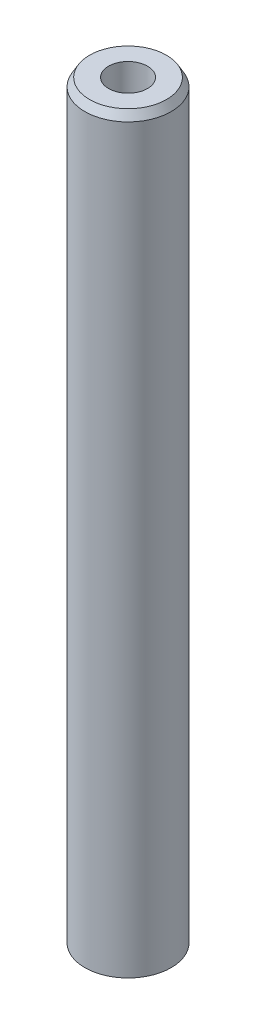
ISO-10303-21;
HEADER;
FILE_DESCRIPTION(('STEP AP214'),'2;1');
FILE_NAME('part.step','',(''),(''),'','','');
FILE_SCHEMA(('AUTOMOTIVE_DESIGN { 1 0 10303 214 1 1 1 1 }'));
ENDSEC;
DATA;
#1=APPLICATION_CONTEXT('core data for automotive mechanical design processes');
#2=APPLICATION_PROTOCOL_DEFINITION('international standard','automotive_design',2000,#1);
#3=PRODUCT_CONTEXT('',#1,'mechanical');
#4=PRODUCT('Part','Part','',(#3));
#5=PRODUCT_RELATED_PRODUCT_CATEGORY('part','',(#4));
#6=PRODUCT_DEFINITION_FORMATION('','',#4);
#7=PRODUCT_DEFINITION_CONTEXT('part definition',#1,'design');
#8=PRODUCT_DEFINITION('design','',#6,#7);
#9=PRODUCT_DEFINITION_SHAPE('','',#8);
#10=(LENGTH_UNIT() NAMED_UNIT(*) SI_UNIT(.MILLI.,.METRE.));
#11=(NAMED_UNIT(*) PLANE_ANGLE_UNIT() SI_UNIT($,.RADIAN.));
#12=(NAMED_UNIT(*) SI_UNIT($,.STERADIAN.) SOLID_ANGLE_UNIT());
#13=UNCERTAINTY_MEASURE_WITH_UNIT(LENGTH_MEASURE(1.E-05),#10,'distance_accuracy_value','');
#14=(GEOMETRIC_REPRESENTATION_CONTEXT(3) GLOBAL_UNCERTAINTY_ASSIGNED_CONTEXT((#13)) GLOBAL_UNIT_ASSIGNED_CONTEXT((#10,
#11,#12)) REPRESENTATION_CONTEXT('',''));
#15=CARTESIAN_POINT('',(0.,0.,0.));
#16=DIRECTION('',(0.,0.,1.));
#17=DIRECTION('',(1.,0.,0.));
#18=AXIS2_PLACEMENT_3D('',#15,#16,#17);
#19=CARTESIAN_POINT('',(0.,480.852490189019,0.));
#20=DIRECTION('',(0.,-1.,0.));
#21=DIRECTION('',(0.,0.,-1.));
#22=AXIS2_PLACEMENT_3D('',#19,#20,#21);
#23=CYLINDRICAL_SURFACE('',#22,27.5);
#24=CARTESIAN_POINT('',(0.,475.674728446264,0.));
#25=DIRECTION('',(0.,1.,0.));
#26=DIRECTION('',(0.,0.,1.));
#27=AXIS2_PLACEMENT_3D('',#24,#25,#26);
#28=CIRCLE('',#27,27.5);
#29=CARTESIAN_POINT('',(0.,475.674728446264,-27.5));
#30=VERTEX_POINT('',#29);
#31=EDGE_CURVE('E50',#30,#30,#28,.F.);
#32=CARTESIAN_POINT('',(0.,2.98938213597921,0.));
#33=DIRECTION('',(0.,1.,0.));
#34=DIRECTION('',(0.,0.,1.));
#35=AXIS2_PLACEMENT_3D('',#32,#33,#34);
#36=CIRCLE('',#35,27.5);
#37=CARTESIAN_POINT('',(0.,2.98938213597921,-27.5));
#38=VERTEX_POINT('',#37);
#39=EDGE_CURVE('E51',#38,#38,#36,.T.);
#40=CARTESIAN_POINT('',(0.,475.674728446264,-27.5));
#41=CARTESIAN_POINT('',(0.,470.750922755532,-27.5));
#42=CARTESIAN_POINT('',(0.,465.8271170648,-27.5));
#43=CARTESIAN_POINT('',(0.,455.979505683336,-27.5));
#44=CARTESIAN_POINT('',(0.,451.055699992604,-27.5));
#45=CARTESIAN_POINT('',(0.,441.208088611139,-27.5));
#46=CARTESIAN_POINT('',(0.,436.284282920407,-27.5));
#47=CARTESIAN_POINT('',(0.,426.436671538943,-27.5));
#48=CARTESIAN_POINT('',(0.,421.512865848211,-27.5));
#49=CARTESIAN_POINT('',(0.,411.665254466746,-27.5));
#50=CARTESIAN_POINT('',(0.,406.741448776014,-27.5));
#51=CARTESIAN_POINT('',(0.,396.89383739455,-27.5));
#52=CARTESIAN_POINT('',(0.,391.970031703818,-27.5));
#53=CARTESIAN_POINT('',(0.,382.122420322354,-27.5));
#54=CARTESIAN_POINT('',(0.,377.198614631622,-27.5));
#55=CARTESIAN_POINT('',(0.,367.351003250157,-27.5));
#56=CARTESIAN_POINT('',(0.,362.427197559425,-27.5));
#57=CARTESIAN_POINT('',(0.,352.579586177961,-27.5));
#58=CARTESIAN_POINT('',(0.,347.655780487229,-27.5));
#59=CARTESIAN_POINT('',(0.,337.808169105764,-27.5));
#60=CARTESIAN_POINT('',(0.,332.884363415032,-27.5));
#61=CARTESIAN_POINT('',(0.,323.036752033568,-27.5));
#62=CARTESIAN_POINT('',(0.,318.112946342836,-27.5));
#63=CARTESIAN_POINT('',(0.,308.265334961372,-27.5));
#64=CARTESIAN_POINT('',(0.,303.34152927064,-27.5));
#65=CARTESIAN_POINT('',(0.,293.493917889175,-27.5));
#66=CARTESIAN_POINT('',(0.,288.570112198443,-27.5));
#67=CARTESIAN_POINT('',(0.,278.722500816979,-27.5));
#68=CARTESIAN_POINT('',(0.,273.798695126247,-27.5));
#69=CARTESIAN_POINT('',(0.,263.951083744782,-27.5));
#70=CARTESIAN_POINT('',(0.,259.02727805405,-27.5));
#71=CARTESIAN_POINT('',(0.,249.179666672586,-27.5));
#72=CARTESIAN_POINT('',(0.,244.255860981854,-27.5));
#73=CARTESIAN_POINT('',(0.,234.40824960039,-27.5));
#74=CARTESIAN_POINT('',(0.,229.484443909658,-27.5));
#75=CARTESIAN_POINT('',(0.,219.636832528193,-27.5));
#76=CARTESIAN_POINT('',(0.,214.713026837461,-27.5));
#77=CARTESIAN_POINT('',(0.,204.865415455997,-27.5));
#78=CARTESIAN_POINT('',(0.,199.941609765265,-27.5));
#79=CARTESIAN_POINT('',(0.,190.0939983838,-27.5));
#80=CARTESIAN_POINT('',(0.,185.170192693068,-27.5));
#81=CARTESIAN_POINT('',(0.,175.322581311604,-27.5));
#82=CARTESIAN_POINT('',(0.,170.398775620872,-27.5));
#83=CARTESIAN_POINT('',(0.,160.551164239408,-27.5));
#84=CARTESIAN_POINT('',(0.,155.627358548675,-27.5));
#85=CARTESIAN_POINT('',(0.,145.779747167211,-27.5));
#86=CARTESIAN_POINT('',(0.,140.855941476479,-27.5));
#87=CARTESIAN_POINT('',(0.,131.008330095015,-27.5));
#88=CARTESIAN_POINT('',(0.,126.084524404283,-27.5));
#89=CARTESIAN_POINT('',(0.,116.236913022818,-27.5));
#90=CARTESIAN_POINT('',(0.,111.313107332086,-27.5));
#91=CARTESIAN_POINT('',(0.,101.465495950622,-27.5));
#92=CARTESIAN_POINT('',(0.,96.5416902598898,-27.5));
#93=CARTESIAN_POINT('',(0.,86.6940788784255,-27.5));
#94=CARTESIAN_POINT('',(0.,81.7702731876934,-27.5));
#95=CARTESIAN_POINT('',(0.,71.9226618062291,-27.5));
#96=CARTESIAN_POINT('',(0.,66.998856115497,-27.5));
#97=CARTESIAN_POINT('',(0.,57.1512447340328,-27.5));
#98=CARTESIAN_POINT('',(0.,52.2274390433006,-27.5));
#99=CARTESIAN_POINT('',(0.,42.3798276618363,-27.5));
#100=CARTESIAN_POINT('',(0.,37.4560219711042,-27.5));
#101=CARTESIAN_POINT('',(0.,27.6084105896399,-27.5));
#102=CARTESIAN_POINT('',(0.,22.6846048989078,-27.5));
#103=CARTESIAN_POINT('',(0.,12.8369935174435,-27.5));
#104=CARTESIAN_POINT('',(0.,7.91318782671135,-27.5));
#105=CARTESIAN_POINT('',(0.,2.98938213597921,-27.5));
#106=B_SPLINE_CURVE_WITH_KNOTS('',3,(#40,#41,#42,#43,#44,#45,#46,#47,#48,#49,#50,#51,#52,#53,
#54,#55,#56,#57,#58,#59,#60,#61,#62,#63,#64,#65,#66,#67,#68,#69,#70,#71,#72,#73,#74,#75,#76,#77,
#78,#79,#80,#81,#82,#83,#84,#85,#86,#87,#88,#89,#90,#91,#92,#93,#94,#95,#96,#97,#98,#99,#100,
#101,#102,#103,#104,#105),.UNSPECIFIED.,.F.,.F.,(4,2,2,2,2,2,2,2,2,2,2,2,2,2,2,2,2,2,2,2,2,2,2,
2,2,2,2,2,2,2,2,2,4),(0.,14.7714170721964,29.5428341443928,44.3142512165892,59.0856682887856,
73.857085360982,88.6285024331784,103.399919505375,118.171336577571,132.942753649768,
147.714170721964,162.48558779416,177.257004866357,192.028421938553,206.79983901075,
221.571256082946,236.342673155142,251.114090227339,265.885507299535,280.656924371732,
295.428341443928,310.199758516124,324.971175588321,339.742592660517,354.514009732714,
369.28542680491,384.056843877107,398.828260949303,413.599678021499,428.371095093696,
443.142512165892,457.913929238089,472.685346310285),.UNSPECIFIED.);
#107=EDGE_CURVE('BSEAM39',#30,#38,#106,.T.);
#108=ORIENTED_EDGE('',*,*,#31,.T.);
#109=ORIENTED_EDGE('',*,*,#39,.T.);
#110=ORIENTED_EDGE('',*,*,#107,.T.);
#111=ORIENTED_EDGE('',*,*,#107,.F.);
#112=EDGE_LOOP('',(#108,#110,#109,#111));
#113=FACE_BOUND('',#112,.T.);
#114=ADVANCED_FACE('F39',(#113),#23,.T.);
#115=CARTESIAN_POINT('',(0.,480.852490189019,0.));
#116=DIRECTION('',(0.,1.,0.));
#117=DIRECTION('',(0.,0.,1.));
#118=AXIS2_PLACEMENT_3D('',#115,#116,#117);
#119=PLANE('',#118);
#120=CARTESIAN_POINT('',(0.,480.852490189019,0.));
#121=DIRECTION('',(0.,1.,0.));
#122=DIRECTION('',(0.,0.,1.));
#123=AXIS2_PLACEMENT_3D('',#120,#121,#122);
#124=CIRCLE('',#123,24.5106178640207);
#125=CARTESIAN_POINT('',(0.,480.852490189019,-24.5106178640207));
#126=VERTEX_POINT('',#125);
#127=EDGE_CURVE('E54',#126,#126,#124,.T.);
#128=ORIENTED_EDGE('',*,*,#127,.T.);
#129=EDGE_LOOP('',(#128));
#130=FACE_BOUND('',#129,.T.);
#131=CARTESIAN_POINT('',(0.,480.852490189019,0.));
#132=DIRECTION('',(0.,1.,0.));
#133=DIRECTION('',(0.,0.,1.));
#134=AXIS2_PLACEMENT_3D('',#131,#132,#133);
#135=CIRCLE('',#134,12.4075242570736);
#136=CARTESIAN_POINT('',(0.,480.852490189019,12.4075242570736));
#137=VERTEX_POINT('',#136);
#138=EDGE_CURVE('E58',#137,#137,#135,.T.);
#139=ORIENTED_EDGE('',*,*,#138,.F.);
#140=EDGE_LOOP('',(#139));
#141=FACE_BOUND('',#140,.T.);
#142=ADVANCED_FACE('F69',(#130,#141),#119,.T.);
#143=CARTESIAN_POINT('',(0.,0.,0.));
#144=DIRECTION('',(0.,1.,0.));
#145=DIRECTION('',(0.,0.,1.));
#146=AXIS2_PLACEMENT_3D('',#143,#144,#145);
#147=PLANE('',#146);
#148=CARTESIAN_POINT('',(0.,0.,0.));
#149=DIRECTION('',(0.,1.,0.));
#150=DIRECTION('',(0.,0.,1.));
#151=AXIS2_PLACEMENT_3D('',#148,#149,#150);
#152=CIRCLE('',#151,22.3222382572452);
#153=CARTESIAN_POINT('',(0.,0.,22.3222382572452));
#154=VERTEX_POINT('',#153);
#155=EDGE_CURVE('E10',#154,#154,#152,.F.);
#156=ORIENTED_EDGE('',*,*,#155,.T.);
#157=EDGE_LOOP('',(#156));
#158=FACE_BOUND('',#157,.T.);
#159=CARTESIAN_POINT('',(0.,0.,0.));
#160=DIRECTION('',(0.,1.,0.));
#161=DIRECTION('',(0.,0.,1.));
#162=AXIS2_PLACEMENT_3D('',#159,#160,#161);
#163=CIRCLE('',#162,12.4075242570736);
#164=CARTESIAN_POINT('',(0.,0.,12.4075242570736));
#165=VERTEX_POINT('',#164);
#166=EDGE_CURVE('E63',#165,#165,#163,.T.);
#167=ORIENTED_EDGE('',*,*,#166,.T.);
#168=EDGE_LOOP('',(#167));
#169=FACE_BOUND('',#168,.T.);
#170=ADVANCED_FACE('F75',(#158,#169),#147,.F.);
#171=CARTESIAN_POINT('',(0.,480.852490189019,0.));
#172=DIRECTION('',(0.,-1.,0.));
#173=DIRECTION('',(0.,0.,-1.));
#174=AXIS2_PLACEMENT_3D('',#171,#172,#173);
#175=CYLINDRICAL_SURFACE('',#174,12.4075242570736);
#176=ORIENTED_EDGE('',*,*,#138,.T.);
#177=EDGE_LOOP('',(#176));
#178=FACE_BOUND('',#177,.T.);
#179=ORIENTED_EDGE('',*,*,#166,.F.);
#180=EDGE_LOOP('',(#179));
#181=FACE_BOUND('',#180,.T.);
#182=ADVANCED_FACE('F70',(#178,#181),#175,.F.);
#183=CARTESIAN_POINT('',(0.,480.852490189019,0.));
#184=DIRECTION('',(0.,-1.,0.));
#185=DIRECTION('',(0.,0.,-1.));
#186=AXIS2_PLACEMENT_3D('',#183,#184,#185);
#187=CONICAL_SURFACE('',#186,24.5106178640207,0.5235987755983);
#188=CARTESIAN_POINT('',(0.,475.674728446264,-27.5));
#189=CARTESIAN_POINT('',(0.,475.728663464418,-27.4688606027502));
#190=CARTESIAN_POINT('',(0.,475.782598482572,-27.4377212055004));
#191=CARTESIAN_POINT('',(0.,475.890468518879,-27.3754424110009));
#192=CARTESIAN_POINT('',(0.,475.944403537033,-27.3443030137511));
#193=CARTESIAN_POINT('',(0.,476.05227357334,-27.2820242192515));
#194=CARTESIAN_POINT('',(0.,476.106208591494,-27.2508848220017));
#195=CARTESIAN_POINT('',(0.,476.214078627801,-27.1886060275022));
#196=CARTESIAN_POINT('',(0.,476.268013645955,-27.1574666302524));
#197=CARTESIAN_POINT('',(0.,476.375883682262,-27.0951878357528));
#198=CARTESIAN_POINT('',(0.,476.429818700416,-27.064048438503));
#199=CARTESIAN_POINT('',(0.,476.537688736723,-27.0017696440035));
#200=CARTESIAN_POINT('',(0.,476.591623754877,-26.9706302467537));
#201=CARTESIAN_POINT('',(0.,476.699493791185,-26.9083514522541));
#202=CARTESIAN_POINT('',(0.,476.753428809338,-26.8772120550043));
#203=CARTESIAN_POINT('',(0.,476.861298845646,-26.8149332605048));
#204=CARTESIAN_POINT('',(0.,476.915233863799,-26.783793863255));
#205=CARTESIAN_POINT('',(0.,477.023103900107,-26.7215150687554));
#206=CARTESIAN_POINT('',(0.,477.07703891826,-26.6903756715056));
#207=CARTESIAN_POINT('',(0.,477.184908954568,-26.6280968770061));
#208=CARTESIAN_POINT('',(0.,477.238843972721,-26.5969574797563));
#209=CARTESIAN_POINT('',(0.,477.346714009029,-26.5346786852567));
#210=CARTESIAN_POINT('',(0.,477.400649027183,-26.5035392880069));
#211=CARTESIAN_POINT('',(0.,477.50851906349,-26.4412604935073));
#212=CARTESIAN_POINT('',(0.,477.562454081644,-26.4101210962576));
#213=CARTESIAN_POINT('',(0.,477.670324117951,-26.347842301758));
#214=CARTESIAN_POINT('',(0.,477.724259136105,-26.3167029045082));
#215=CARTESIAN_POINT('',(0.,477.832129172412,-26.2544241100086));
#216=CARTESIAN_POINT('',(0.,477.886064190566,-26.2232847127589));
#217=CARTESIAN_POINT('',(0.,477.993934226873,-26.1610059182593));
#218=CARTESIAN_POINT('',(0.,478.047869245027,-26.1298665210095));
#219=CARTESIAN_POINT('',(0.,478.155739281334,-26.0675877265099));
#220=CARTESIAN_POINT('',(0.,478.209674299488,-26.0364483292601));
#221=CARTESIAN_POINT('',(0.,478.317544335795,-25.9741695347606));
#222=CARTESIAN_POINT('',(0.,478.371479353949,-25.9430301375108));
#223=CARTESIAN_POINT('',(0.,478.479349390257,-25.8807513430112));
#224=CARTESIAN_POINT('',(0.,478.53328440841,-25.8496119457614));
#225=CARTESIAN_POINT('',(0.,478.641154444718,-25.7873331512619));
#226=CARTESIAN_POINT('',(0.,478.695089462871,-25.7561937540121));
#227=CARTESIAN_POINT('',(0.,478.802959499179,-25.6939149595125));
#228=CARTESIAN_POINT('',(0.,478.856894517332,-25.6627755622627));
#229=CARTESIAN_POINT('',(0.,478.96476455364,-25.6004967677632));
#230=CARTESIAN_POINT('',(0.,479.018699571793,-25.5693573705134));
#231=CARTESIAN_POINT('',(0.,479.126569608101,-25.5070785760138));
#232=CARTESIAN_POINT('',(0.,479.180504626255,-25.475939178764));
#233=CARTESIAN_POINT('',(0.,479.288374662562,-25.4136603842645));
#234=CARTESIAN_POINT('',(0.,479.342309680716,-25.3825209870147));
#235=CARTESIAN_POINT('',(0.,479.450179717023,-25.3202421925151));
#236=CARTESIAN_POINT('',(0.,479.504114735177,-25.2891027952653));
#237=CARTESIAN_POINT('',(0.,479.611984771484,-25.2268240007658));
#238=CARTESIAN_POINT('',(0.,479.665919789638,-25.195684603516));
#239=CARTESIAN_POINT('',(0.,479.773789825945,-25.1334058090164));
#240=CARTESIAN_POINT('',(0.,479.827724844099,-25.1022664117666));
#241=CARTESIAN_POINT('',(0.,479.935594880406,-25.039987617267));
#242=CARTESIAN_POINT('',(0.,479.98952989856,-25.0088482200173));
#243=CARTESIAN_POINT('',(0.,480.097399934867,-24.9465694255177));
#244=CARTESIAN_POINT('',(0.,480.151334953021,-24.9154300282679));
#245=CARTESIAN_POINT('',(0.,480.259204989329,-24.8531512337683));
#246=CARTESIAN_POINT('',(0.,480.313140007482,-24.8220118365186));
#247=CARTESIAN_POINT('',(0.,480.42101004379,-24.759733042019));
#248=CARTESIAN_POINT('',(0.,480.474945061943,-24.7285936447692));
#249=CARTESIAN_POINT('',(0.,480.582815098251,-24.6663148502696));
#250=CARTESIAN_POINT('',(0.,480.636750116404,-24.6351754530199));
#251=CARTESIAN_POINT('',(0.,480.744620152712,-24.5728966585203));
#252=CARTESIAN_POINT('',(0.,480.798555170865,-24.5417572612705));
#253=CARTESIAN_POINT('',(0.,480.852490189019,-24.5106178640207));
#254=B_SPLINE_CURVE_WITH_KNOTS('',3,(#188,#189,#190,#191,#192,#193,#194,#195,#196,#197,#198,
#199,#200,#201,#202,#203,#204,#205,#206,#207,#208,#209,#210,#211,#212,#213,#214,#215,#216,#217,
#218,#219,#220,#221,#222,#223,#224,#225,#226,#227,#228,#229,#230,#231,#232,#233,#234,#235,#236,
#237,#238,#239,#240,#241,#242,#243,#244,#245,#246,#247,#248,#249,#250,#251,#252,#253),
.UNSPECIFIED.,.F.,.F.,(4,2,2,2,2,2,2,2,2,2,2,2,2,2,2,2,2,2,2,2,2,2,2,2,2,2,2,2,2,2,2,2,4),(0.,
0.186836383498681,0.37367276699741,0.560509150496091,0.74734553399482,0.934181917493501,
1.12101830099223,1.30785468449091,1.49469106798964,1.68152745148832,1.86836383498705,
2.05520021848573,2.24203660198446,2.42887298548314,2.61570936898187,2.80254575248055,
2.98938213597927,3.176218519478,3.36305490297668,3.54989128647541,3.73672766997409,
3.92356405347282,4.1104004369715,4.29723682047023,4.48407320396891,4.67090958746764,
4.85774597096632,5.04458235446505,5.23141873796373,5.41825512146246,5.60509150496114,
5.79192788845987,5.9787642719586),.UNSPECIFIED.);
#255=EDGE_CURVE('BSEAM81',#30,#126,#254,.T.);
#256=ORIENTED_EDGE('',*,*,#31,.F.);
#257=ORIENTED_EDGE('',*,*,#127,.F.);
#258=ORIENTED_EDGE('',*,*,#255,.T.);
#259=ORIENTED_EDGE('',*,*,#255,.F.);
#260=EDGE_LOOP('',(#256,#258,#257,#259));
#261=FACE_BOUND('',#260,.T.);
#262=ADVANCED_FACE('F81',(#261),#187,.T.);
#263=CARTESIAN_POINT('',(0.,2.98938213597921,0.));
#264=DIRECTION('',(0.,1.,0.));
#265=DIRECTION('',(0.,0.,1.));
#266=AXIS2_PLACEMENT_3D('',#263,#264,#265);
#267=CONICAL_SURFACE('',#266,27.5,1.0471975511966);
#268=ORIENTED_EDGE('',*,*,#155,.F.);
#269=EDGE_LOOP('',(#268));
#270=FACE_BOUND('',#269,.T.);
#271=ORIENTED_EDGE('',*,*,#39,.F.);
#272=EDGE_LOOP('',(#271));
#273=FACE_BOUND('',#272,.T.);
#274=ADVANCED_FACE('F45',(#270,#273),#267,.T.);
#275=CLOSED_SHELL('',(#114,#142,#170,#182,#262,#274));
#276=MANIFOLD_SOLID_BREP('B2',#275);
#277=ADVANCED_BREP_SHAPE_REPRESENTATION('',(#18,#276),#14);
#278=SHAPE_DEFINITION_REPRESENTATION(#9,#277);
ENDSEC;
END-ISO-10303-21;
